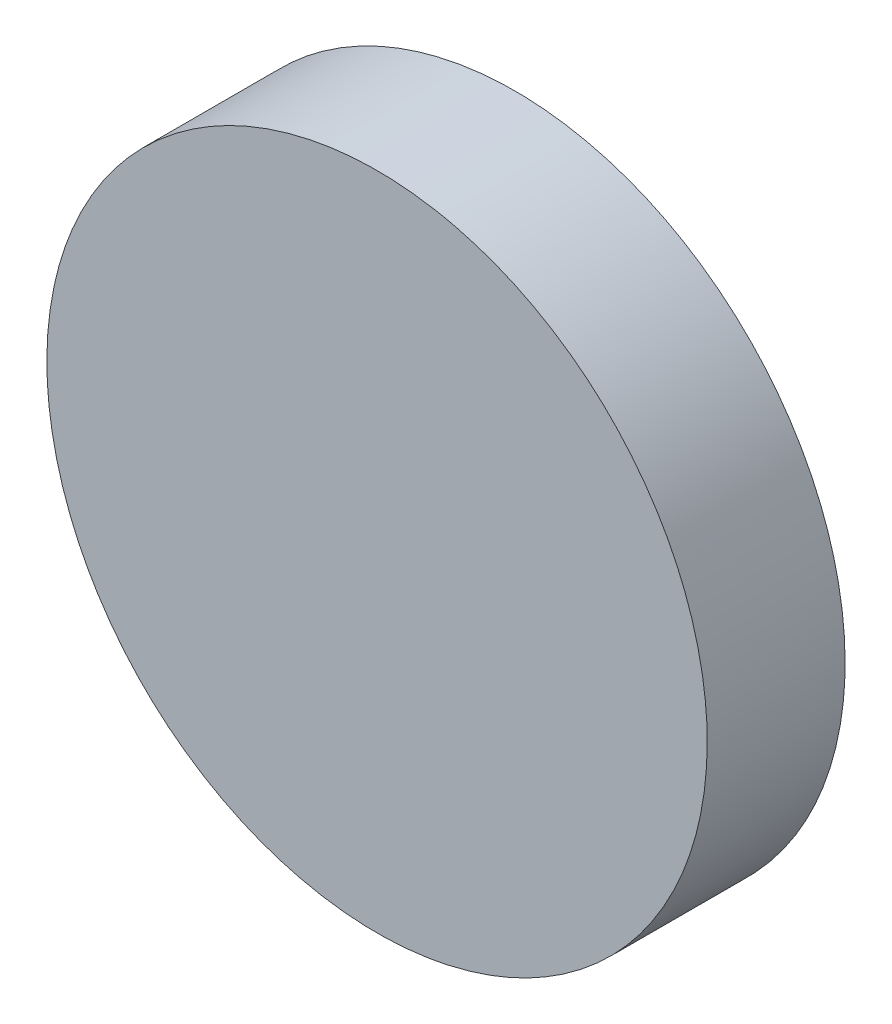
ISO-10303-21;
HEADER;
FILE_DESCRIPTION(('STEP AP214'),'2;1');
FILE_NAME('part.step','',(''),(''),'','','');
FILE_SCHEMA(('AUTOMOTIVE_DESIGN { 1 0 10303 214 1 1 1 1 }'));
ENDSEC;
DATA;
#1=APPLICATION_CONTEXT('core data for automotive mechanical design processes');
#2=APPLICATION_PROTOCOL_DEFINITION('international standard','automotive_design',2000,#1);
#3=PRODUCT_CONTEXT('',#1,'mechanical');
#4=PRODUCT('Part','Part','',(#3));
#5=PRODUCT_RELATED_PRODUCT_CATEGORY('part','',(#4));
#6=PRODUCT_DEFINITION_FORMATION('','',#4);
#7=PRODUCT_DEFINITION_CONTEXT('part definition',#1,'design');
#8=PRODUCT_DEFINITION('design','',#6,#7);
#9=PRODUCT_DEFINITION_SHAPE('','',#8);
#10=(LENGTH_UNIT() NAMED_UNIT(*) SI_UNIT(.MILLI.,.METRE.));
#11=(NAMED_UNIT(*) PLANE_ANGLE_UNIT() SI_UNIT($,.RADIAN.));
#12=(NAMED_UNIT(*) SI_UNIT($,.STERADIAN.) SOLID_ANGLE_UNIT());
#13=UNCERTAINTY_MEASURE_WITH_UNIT(LENGTH_MEASURE(1.E-05),#10,'distance_accuracy_value','');
#14=(GEOMETRIC_REPRESENTATION_CONTEXT(3) GLOBAL_UNCERTAINTY_ASSIGNED_CONTEXT((#13)) GLOBAL_UNIT_ASSIGNED_CONTEXT((#10,
#11,#12)) REPRESENTATION_CONTEXT('',''));
#15=CARTESIAN_POINT('',(0.,0.,0.));
#16=DIRECTION('',(0.,0.,1.));
#17=DIRECTION('',(1.,0.,0.));
#18=AXIS2_PLACEMENT_3D('',#15,#16,#17);
#19=CARTESIAN_POINT('',(7.59384062043357,-7.85,7.2343687668426));
#20=CARTESIAN_POINT('',(7.59384062043357,-7.64139482578253,7.2343687668426));
#21=CARTESIAN_POINT('',(7.51085232233108,-7.22418447734758,7.2343687668426));
#22=CARTESIAN_POINT('',(7.15635630501285,-6.69364369498715,7.2343687668426));
#23=CARTESIAN_POINT('',(6.62581552265242,-6.33914767766892,7.2343687668426));
#24=CARTESIAN_POINT('',(6.,-6.21466523051519,7.2343687668426));
#25=CARTESIAN_POINT('',(5.37418447734758,-6.33914767766892,7.2343687668426));
#26=CARTESIAN_POINT('',(4.84364369498715,-6.69364369498715,7.2343687668426));
#27=CARTESIAN_POINT('',(4.48914767766892,-7.22418447734758,7.2343687668426));
#28=CARTESIAN_POINT('',(4.36466523051519,-7.85,7.2343687668426));
#29=CARTESIAN_POINT('',(4.48914767766892,-8.47581552265242,7.2343687668426));
#30=CARTESIAN_POINT('',(4.84364369498715,-9.00635630501285,7.2343687668426));
#31=CARTESIAN_POINT('',(5.37418447734758,-9.36085232233108,7.2343687668426));
#32=CARTESIAN_POINT('',(6.,-9.48533476948481,7.2343687668426));
#33=CARTESIAN_POINT('',(6.62581552265242,-9.36085232233108,7.2343687668426));
#34=CARTESIAN_POINT('',(7.15635630501285,-9.00635630501285,7.2343687668426));
#35=CARTESIAN_POINT('',(7.51085232233108,-8.47581552265242,7.2343687668426));
#36=CARTESIAN_POINT('',(7.59384062043357,-8.05860517421747,7.2343687668426));
#37=CARTESIAN_POINT('',(7.59384062043357,-7.85,7.2343687668426));
#38=B_SPLINE_CURVE_WITH_KNOTS('',3,(#19,#20,#21,#22,#23,#24,#25,#26,#27,#28,#29,#30,#31,#32,#33,
#34,#35,#36,#37),.UNSPECIFIED.,.T.,.F.,(4,1,1,1,1,1,1,1,1,1,1,1,1,1,1,1,4),(0.,0.0625,0.125,
0.1875,0.25,0.3125,0.375,0.4375,0.5,0.5625,0.625,0.6875,0.75,0.8125,0.875,0.9375,1.),.UNSPECIFIED.);
#39=DIRECTION('',(0.,0.,1.));
#40=VECTOR('',#39,1.);
#41=SURFACE_OF_LINEAR_EXTRUSION('',#38,#40);
#42=CARTESIAN_POINT('',(7.59384062043357,-7.85,7.2343687668426));
#43=CARTESIAN_POINT('',(7.59384062043357,-7.64139482578253,7.2343687668426));
#44=CARTESIAN_POINT('',(7.51085232233108,-7.22418447734758,7.2343687668426));
#45=CARTESIAN_POINT('',(7.15635630501285,-6.69364369498715,7.2343687668426));
#46=CARTESIAN_POINT('',(6.62581552265242,-6.33914767766892,7.2343687668426));
#47=CARTESIAN_POINT('',(6.,-6.21466523051519,7.2343687668426));
#48=CARTESIAN_POINT('',(5.37418447734758,-6.33914767766892,7.2343687668426));
#49=CARTESIAN_POINT('',(4.84364369498715,-6.69364369498715,7.2343687668426));
#50=CARTESIAN_POINT('',(4.48914767766892,-7.22418447734758,7.2343687668426));
#51=CARTESIAN_POINT('',(4.36466523051519,-7.85,7.2343687668426));
#52=CARTESIAN_POINT('',(4.48914767766892,-8.47581552265242,7.2343687668426));
#53=CARTESIAN_POINT('',(4.84364369498715,-9.00635630501285,7.2343687668426));
#54=CARTESIAN_POINT('',(5.37418447734758,-9.36085232233108,7.2343687668426));
#55=CARTESIAN_POINT('',(6.,-9.48533476948481,7.2343687668426));
#56=CARTESIAN_POINT('',(6.62581552265242,-9.36085232233108,7.2343687668426));
#57=CARTESIAN_POINT('',(7.15635630501285,-9.00635630501285,7.2343687668426));
#58=CARTESIAN_POINT('',(7.51085232233108,-8.47581552265242,7.2343687668426));
#59=CARTESIAN_POINT('',(7.59384062043357,-8.05860517421747,7.2343687668426));
#60=CARTESIAN_POINT('',(7.59384062043357,-7.85,7.2343687668426));
#61=B_SPLINE_CURVE_WITH_KNOTS('',3,(#42,#43,#44,#45,#46,#47,#48,#49,#50,#51,#52,#53,#54,#55,#56,
#57,#58,#59,#60),.UNSPECIFIED.,.T.,.F.,(4,1,1,1,1,1,1,1,1,1,1,1,1,1,1,1,4),(0.,0.0625,0.125,
0.1875,0.25,0.3125,0.375,0.4375,0.5,0.5625,0.625,0.6875,0.75,0.8125,0.875,0.9375,1.),.UNSPECIFIED.);
#62=CARTESIAN_POINT('',(7.59384062043357,-7.85,7.2343687668426));
#63=VERTEX_POINT('',#62);
#64=EDGE_CURVE('E9',#63,#63,#61,.T.);
#65=ORIENTED_EDGE('',*,*,#64,.T.);
#66=EDGE_LOOP('',(#65));
#67=FACE_BOUND('',#66,.T.);
#68=CARTESIAN_POINT('',(7.59384062043357,-7.85,7.9));
#69=CARTESIAN_POINT('',(7.59384063931159,-7.87607626205079,7.9));
#70=CARTESIAN_POINT('',(7.59319224601673,-7.90215198285669,7.9));
#71=CARTESIAN_POINT('',(7.59061118055504,-7.9542414022198,7.9));
#72=CARTESIAN_POINT('',(7.58867843283268,-7.9802550970378,7.9));
#73=CARTESIAN_POINT('',(7.58354103066983,-8.03215822267473,7.9));
#74=CARTESIAN_POINT('',(7.58033628894762,-8.0580476448429,7.9));
#75=CARTESIAN_POINT('',(7.57266722700935,-8.10964035851338,7.9));
#76=CARTESIAN_POINT('',(7.56820285246934,-8.13534364193907,7.9));
#77=CARTESIAN_POINT('',(7.55802680332689,-8.18650209986784,7.9));
#78=CARTESIAN_POINT('',(7.55231512872446,-8.21195727437092,7.9));
#79=CARTESIAN_POINT('',(7.53965673600478,-8.26255755947254,7.9));
#80=CARTESIAN_POINT('',(7.53271007116753,-8.28770268339727,7.9));
#81=CARTESIAN_POINT('',(7.51759396529987,-8.33762087734628,7.9));
#82=CARTESIAN_POINT('',(7.50942460821543,-8.3623939727844,7.9));
#83=CARTESIAN_POINT('',(7.49187537053595,-8.41150620297505,7.9));
#84=CARTESIAN_POINT('',(7.48249556118352,-8.43584536317147,7.9));
#85=CARTESIAN_POINT('',(7.4625378934238,-8.48402743536936,7.9));
#86=CARTESIAN_POINT('',(7.4519600350165,-8.50787034737083,7.9));
#87=CARTESIAN_POINT('',(7.42964162893058,-8.55500712338237,7.9));
#88=CARTESIAN_POINT('',(7.41790101288425,-8.57830095500787,7.9));
#89=CARTESIAN_POINT('',(7.393292220576,-8.62428714926546,7.9));
#90=CARTESIAN_POINT('',(7.38042396698504,-8.64697947050907,7.9));
#91=CARTESIAN_POINT('',(7.35359499694329,-8.69171011113872,7.9));
#92=CARTESIAN_POINT('',(7.33963423339477,-8.71374840227321,7.9));
#93=CARTESIAN_POINT('',(7.31065529664887,-8.75711844600313,7.9));
#94=CARTESIAN_POINT('',(7.29563712345149,-8.77845019859857,7.9));
#95=CARTESIAN_POINT('',(7.26457840243973,-8.82035460998663,7.9));
#96=CARTESIAN_POINT('',(7.24853789874991,-8.84092730148047,7.9));
#97=CARTESIAN_POINT('',(7.21546957220525,-8.8812610156734,7.9));
#98=CARTESIAN_POINT('',(7.19844181718092,-8.90102209397652,7.9));
#99=CARTESIAN_POINT('',(7.16343399883695,-8.93968007579376,7.9));
#100=CARTESIAN_POINT('',(7.14545399159995,-8.95857703007835,7.9));
#101=CARTESIAN_POINT('',(7.10857703007835,-8.99545399159994,7.9));
#102=CARTESIAN_POINT('',(7.08968007579376,-9.01343399883694,7.9));
#103=CARTESIAN_POINT('',(7.05102209397652,-9.04844181718091,7.9));
#104=CARTESIAN_POINT('',(7.0312610156734,-9.06546957220525,7.9));
#105=CARTESIAN_POINT('',(6.99092730148048,-9.09853789874991,7.9));
#106=CARTESIAN_POINT('',(6.97035460998665,-9.11457840243973,7.9));
#107=CARTESIAN_POINT('',(6.92845019859856,-9.14563712345149,7.9));
#108=CARTESIAN_POINT('',(6.90711844600309,-9.16065529664887,7.9));
#109=CARTESIAN_POINT('',(6.86374840227325,-9.18963423339477,7.9));
#110=CARTESIAN_POINT('',(6.84171011113888,-9.20359499694329,7.9));
#111=CARTESIAN_POINT('',(6.79697947050891,-9.23042396698503,7.9));
#112=CARTESIAN_POINT('',(6.77428714926487,-9.24329222057596,7.9));
#113=CARTESIAN_POINT('',(6.72830095500848,-9.26790101288428,7.9));
#114=CARTESIAN_POINT('',(6.7050071233846,-9.27964162893071,7.9));
#115=CARTESIAN_POINT('',(6.65787034736861,-9.30196003501637,7.9));
#116=CARTESIAN_POINT('',(6.63402743536107,-9.3125378934233,7.9));
#117=CARTESIAN_POINT('',(6.58584536317978,-9.33249556118402,7.9));
#118=CARTESIAN_POINT('',(6.56150620300604,-9.34187537053782,7.9));
#119=CARTESIAN_POINT('',(6.51239397275342,-9.35942460821356,7.9));
#120=CARTESIAN_POINT('',(6.48762087723062,-9.36759396529288,7.9));
#121=CARTESIAN_POINT('',(6.43770268351295,-9.38271007117451,7.9));
#122=CARTESIAN_POINT('',(6.41255755990424,-9.38965673603087,7.9));
#123=CARTESIAN_POINT('',(6.3619572739392,-9.40231512869838,7.9));
#124=CARTESIAN_POINT('',(6.33650209825663,-9.40802680322955,7.9));
#125=CARTESIAN_POINT('',(6.2853436435503,-9.41820285256667,7.9));
#126=CARTESIAN_POINT('',(6.25964036452654,-9.42266722737262,7.9));
#127=CARTESIAN_POINT('',(6.20804763883,-9.43033628858437,7.9));
#128=CARTESIAN_POINT('',(6.18215820023473,-9.4335410293142,7.9));
#129=CARTESIAN_POINT('',(6.13025511947626,-9.43867843418823,7.9));
#130=CARTESIAN_POINT('',(6.10424148595847,-9.44061118561383,7.9));
#131=CARTESIAN_POINT('',(6.05215189912295,-9.44319224095822,7.9));
#132=CARTESIAN_POINT('',(6.02607594956148,-9.44384062043356,7.9));
#133=CARTESIAN_POINT('',(5.97392405043853,-9.44384062043356,7.9));
#134=CARTESIAN_POINT('',(5.94784810087706,-9.44319224095823,7.9));
#135=CARTESIAN_POINT('',(5.89575851404153,-9.44061118561384,7.9));
#136=CARTESIAN_POINT('',(5.86974488052374,-9.43867843418823,7.9));
#137=CARTESIAN_POINT('',(5.81784179976527,-9.43354102931419,7.9));
#138=CARTESIAN_POINT('',(5.79195236117,-9.43033628858437,7.9));
#139=CARTESIAN_POINT('',(5.74035963547346,-9.42266722737262,7.9));
#140=CARTESIAN_POINT('',(5.71465635644971,-9.41820285256667,7.9));
#141=CARTESIAN_POINT('',(5.66349790174338,-9.40802680322955,7.9));
#142=CARTESIAN_POINT('',(5.6380427260608,-9.40231512869838,7.9));
#143=CARTESIAN_POINT('',(5.58744244009577,-9.38965673603087,7.9));
#144=CARTESIAN_POINT('',(5.56229731648706,-9.38271007117451,7.9));
#145=CARTESIAN_POINT('',(5.51237912276938,-9.36759396529288,7.9));
#146=CARTESIAN_POINT('',(5.48760602724659,-9.35942460821356,7.9));
#147=CARTESIAN_POINT('',(5.43849379699396,-9.34187537053782,7.9));
#148=CARTESIAN_POINT('',(5.41415463682022,-9.33249556118402,7.9));
#149=CARTESIAN_POINT('',(5.36597256463894,-9.3125378934233,7.9));
#150=CARTESIAN_POINT('',(5.3421296526314,-9.30196003501637,7.9));
#151=CARTESIAN_POINT('',(5.2949928766154,-9.27964162893071,7.9));
#152=CARTESIAN_POINT('',(5.27169904499153,-9.26790101288428,7.9));
#153=CARTESIAN_POINT('',(5.22571285073514,-9.24329222057596,7.9));
#154=CARTESIAN_POINT('',(5.20302052949109,-9.23042396698503,7.9));
#155=CARTESIAN_POINT('',(5.15828988886112,-9.20359499694329,7.9));
#156=CARTESIAN_POINT('',(5.13625159772675,-9.18963423339477,7.9));
#157=CARTESIAN_POINT('',(5.09288155399691,-9.16065529664887,7.9));
#158=CARTESIAN_POINT('',(5.07154980140144,-9.14563712345149,7.9));
#159=CARTESIAN_POINT('',(5.02964539001336,-9.11457840243973,7.9));
#160=CARTESIAN_POINT('',(5.00907269851952,-9.09853789874991,7.9));
#161=CARTESIAN_POINT('',(4.9687389843266,-9.06546957220525,7.9));
#162=CARTESIAN_POINT('',(4.94897790602348,-9.04844181718091,7.9));
#163=CARTESIAN_POINT('',(4.91031992420624,-9.01343399883694,7.9));
#164=CARTESIAN_POINT('',(4.89142296992165,-8.99545399159994,7.9));
#165=CARTESIAN_POINT('',(4.85454600840006,-8.95857703007835,7.9));
#166=CARTESIAN_POINT('',(4.83656600116306,-8.93968007579376,7.9));
#167=CARTESIAN_POINT('',(4.80155818281909,-8.90102209397652,7.9));
#168=CARTESIAN_POINT('',(4.78453042779475,-8.8812610156734,7.9));
#169=CARTESIAN_POINT('',(4.75146210125009,-8.84092730148048,7.9));
#170=CARTESIAN_POINT('',(4.73542159756027,-8.82035460998664,7.9));
#171=CARTESIAN_POINT('',(4.70436287654851,-8.77845019859856,7.9));
#172=CARTESIAN_POINT('',(4.68934470335113,-8.75711844600309,7.9));
#173=CARTESIAN_POINT('',(4.66036576660523,-8.71374840227325,7.9));
#174=CARTESIAN_POINT('',(4.64640500305671,-8.69171011113888,7.9));
#175=CARTESIAN_POINT('',(4.61957603301497,-8.64697947050891,7.9));
#176=CARTESIAN_POINT('',(4.60670777942403,-8.62428714926486,7.9));
#177=CARTESIAN_POINT('',(4.58209898711572,-8.57830095500847,7.9));
#178=CARTESIAN_POINT('',(4.57035837106929,-8.5550071233846,7.9));
#179=CARTESIAN_POINT('',(4.54803996498363,-8.5078703473686,7.9));
#180=CARTESIAN_POINT('',(4.5374621065767,-8.48402743536106,7.9));
#181=CARTESIAN_POINT('',(4.51750443881598,-8.43584536317978,7.9));
#182=CARTESIAN_POINT('',(4.50812462946218,-8.41150620300604,7.9));
#183=CARTESIAN_POINT('',(4.49057539178644,-8.36239397275341,7.9));
#184=CARTESIAN_POINT('',(4.48240603470712,-8.33762087723062,7.9));
#185=CARTESIAN_POINT('',(4.46728992882549,-8.28770268351294,7.9));
#186=CARTESIAN_POINT('',(4.46034326396914,-8.26255755990423,7.9));
#187=CARTESIAN_POINT('',(4.44768487130163,-8.2119572739392,7.9));
#188=CARTESIAN_POINT('',(4.44197319677045,-8.18650209825662,7.9));
#189=CARTESIAN_POINT('',(4.43179714743333,-8.13534364355029,7.9));
#190=CARTESIAN_POINT('',(4.42733277262739,-8.10964036452654,7.9));
#191=CARTESIAN_POINT('',(4.41966371141564,-8.05804763883,7.9));
#192=CARTESIAN_POINT('',(4.41645897068581,-8.03215820023473,7.9));
#193=CARTESIAN_POINT('',(4.41132156581178,-7.98025511947626,7.9));
#194=CARTESIAN_POINT('',(4.40938881438617,-7.95424148595847,7.9));
#195=CARTESIAN_POINT('',(4.40680775904178,-7.90215189912294,7.9));
#196=CARTESIAN_POINT('',(4.40615937956644,-7.87607594956147,7.9));
#197=CARTESIAN_POINT('',(4.40615937956644,-7.82392405043853,7.9));
#198=CARTESIAN_POINT('',(4.40680775904178,-7.79784810087705,7.9));
#199=CARTESIAN_POINT('',(4.40938881438617,-7.74575851404153,7.9));
#200=CARTESIAN_POINT('',(4.41132156581178,-7.71974488052374,7.9));
#201=CARTESIAN_POINT('',(4.41645897068581,-7.66784179976527,7.9));
#202=CARTESIAN_POINT('',(4.41966371141563,-7.64195236117,7.9));
#203=CARTESIAN_POINT('',(4.42733277262739,-7.59035963547346,7.9));
#204=CARTESIAN_POINT('',(4.43179714743333,-7.5646563564497,7.9));
#205=CARTESIAN_POINT('',(4.44197319677045,-7.51349790174337,7.9));
#206=CARTESIAN_POINT('',(4.44768487130163,-7.4880427260608,7.9));
#207=CARTESIAN_POINT('',(4.46034326396914,-7.43744244009577,7.9));
#208=CARTESIAN_POINT('',(4.46728992882549,-7.41229731648706,7.9));
#209=CARTESIAN_POINT('',(4.48240603470712,-7.36237912276938,7.9));
#210=CARTESIAN_POINT('',(4.49057539178644,-7.33760602724659,7.9));
#211=CARTESIAN_POINT('',(4.50812462946218,-7.28849379699396,7.9));
#212=CARTESIAN_POINT('',(4.51750443881598,-7.26415463682022,7.9));
#213=CARTESIAN_POINT('',(4.5374621065767,-7.21597256463894,7.9));
#214=CARTESIAN_POINT('',(4.54803996498363,-7.1921296526314,7.9));
#215=CARTESIAN_POINT('',(4.57035837106929,-7.1449928766154,7.9));
#216=CARTESIAN_POINT('',(4.58209898711572,-7.12169904499153,7.9));
#217=CARTESIAN_POINT('',(4.60670777942403,-7.07571285073514,7.9));
#218=CARTESIAN_POINT('',(4.61957603301497,-7.05302052949109,7.9));
#219=CARTESIAN_POINT('',(4.64640500305671,-7.00828988886112,7.9));
#220=CARTESIAN_POINT('',(4.66036576660523,-6.98625159772675,7.9));
#221=CARTESIAN_POINT('',(4.68934470335113,-6.94288155399691,7.9));
#222=CARTESIAN_POINT('',(4.70436287654851,-6.92154980140144,7.9));
#223=CARTESIAN_POINT('',(4.73542159756027,-6.87964539001336,7.9));
#224=CARTESIAN_POINT('',(4.75146210125009,-6.85907269851952,7.9));
#225=CARTESIAN_POINT('',(4.78453042779475,-6.8187389843266,7.9));
#226=CARTESIAN_POINT('',(4.80155818281909,-6.79897790602348,7.9));
#227=CARTESIAN_POINT('',(4.83656600116306,-6.76031992420624,7.9));
#228=CARTESIAN_POINT('',(4.85454600840006,-6.74142296992165,7.9));
#229=CARTESIAN_POINT('',(4.89142296992165,-6.70454600840006,7.9));
#230=CARTESIAN_POINT('',(4.91031992420624,-6.68656600116305,7.9));
#231=CARTESIAN_POINT('',(4.94897790602348,-6.65155818281909,7.9));
#232=CARTESIAN_POINT('',(4.96873898432661,-6.63453042779475,7.9));
#233=CARTESIAN_POINT('',(5.00907269851953,-6.60146210125009,7.9));
#234=CARTESIAN_POINT('',(5.02964539001336,-6.58542159756027,7.9));
#235=CARTESIAN_POINT('',(5.07154980140144,-6.55436287654851,7.9));
#236=CARTESIAN_POINT('',(5.09288155399691,-6.53934470335113,7.9));
#237=CARTESIAN_POINT('',(5.13625159772675,-6.51036576660522,7.9));
#238=CARTESIAN_POINT('',(5.15828988886112,-6.4964050030567,7.9));
#239=CARTESIAN_POINT('',(5.20302052949109,-6.46957603301497,7.9));
#240=CARTESIAN_POINT('',(5.22571285073514,-6.45670777942403,7.9));
#241=CARTESIAN_POINT('',(5.27169904499153,-6.43209898711572,7.9));
#242=CARTESIAN_POINT('',(5.2949928766154,-6.42035837106929,7.9));
#243=CARTESIAN_POINT('',(5.3421296526314,-6.39803996498363,7.9));
#244=CARTESIAN_POINT('',(5.36597256463894,-6.3874621065767,7.9));
#245=CARTESIAN_POINT('',(5.41415463682022,-6.36750443881597,7.9));
#246=CARTESIAN_POINT('',(5.43849379699396,-6.35812462946218,7.9));
#247=CARTESIAN_POINT('',(5.48760602724659,-6.34057539178644,7.9));
#248=CARTESIAN_POINT('',(5.51237912276938,-6.33240603470712,7.9));
#249=CARTESIAN_POINT('',(5.56229731648706,-6.31728992882548,7.9));
#250=CARTESIAN_POINT('',(5.58744244009577,-6.31034326396914,7.9));
#251=CARTESIAN_POINT('',(5.6380427260608,-6.29768487130162,7.9));
#252=CARTESIAN_POINT('',(5.66349790174338,-6.29197319677045,7.9));
#253=CARTESIAN_POINT('',(5.71465635644971,-6.28179714743333,7.9));
#254=CARTESIAN_POINT('',(5.74035963547346,-6.27733277262738,7.9));
#255=CARTESIAN_POINT('',(5.79195236117,-6.26966371141563,7.9));
#256=CARTESIAN_POINT('',(5.81784179976527,-6.2664589706858,7.9));
#257=CARTESIAN_POINT('',(5.86974488052375,-6.26132156581177,7.9));
#258=CARTESIAN_POINT('',(5.89575851404153,-6.25938881438616,7.9));
#259=CARTESIAN_POINT('',(5.94784810087706,-6.25680775904177,7.9));
#260=CARTESIAN_POINT('',(5.97392405043853,-6.25615937956643,7.9));
#261=CARTESIAN_POINT('',(6.02607594956148,-6.25615937956643,7.9));
#262=CARTESIAN_POINT('',(6.05215189912295,-6.25680775904177,7.9));
#263=CARTESIAN_POINT('',(6.10424148595847,-6.25938881438616,7.9));
#264=CARTESIAN_POINT('',(6.13025511947626,-6.26132156581177,7.9));
#265=CARTESIAN_POINT('',(6.18215820023473,-6.2664589706858,7.9));
#266=CARTESIAN_POINT('',(6.20804763883,-6.26966371141563,7.9));
#267=CARTESIAN_POINT('',(6.25964036452654,-6.27733277262738,7.9));
#268=CARTESIAN_POINT('',(6.2853436435503,-6.28179714743333,7.9));
#269=CARTESIAN_POINT('',(6.33650209825663,-6.29197319677045,7.9));
#270=CARTESIAN_POINT('',(6.3619572739392,-6.29768487130162,7.9));
#271=CARTESIAN_POINT('',(6.41255755990424,-6.31034326396914,7.9));
#272=CARTESIAN_POINT('',(6.43770268351294,-6.31728992882549,7.9));
#273=CARTESIAN_POINT('',(6.48762087723062,-6.33240603470712,7.9));
#274=CARTESIAN_POINT('',(6.51239397275342,-6.34057539178644,7.9));
#275=CARTESIAN_POINT('',(6.56150620300604,-6.35812462946218,7.9));
#276=CARTESIAN_POINT('',(6.58584536317978,-6.36750443881597,7.9));
#277=CARTESIAN_POINT('',(6.63402743536106,-6.3874621065767,7.9));
#278=CARTESIAN_POINT('',(6.65787034736861,-6.39803996498363,7.9));
#279=CARTESIAN_POINT('',(6.7050071233846,-6.42035837106929,7.9));
#280=CARTESIAN_POINT('',(6.72830095500848,-6.43209898711572,7.9));
#281=CARTESIAN_POINT('',(6.77428714926487,-6.45670777942403,7.9));
#282=CARTESIAN_POINT('',(6.79697947050891,-6.46957603301497,7.9));
#283=CARTESIAN_POINT('',(6.84171011113888,-6.4964050030567,7.9));
#284=CARTESIAN_POINT('',(6.86374840227325,-6.51036576660522,7.9));
#285=CARTESIAN_POINT('',(6.90711844600309,-6.53934470335113,7.9));
#286=CARTESIAN_POINT('',(6.92845019859856,-6.55436287654851,7.9));
#287=CARTESIAN_POINT('',(6.97035460998665,-6.58542159756027,7.9));
#288=CARTESIAN_POINT('',(6.99092730148048,-6.60146210125009,7.9));
#289=CARTESIAN_POINT('',(7.0312610156734,-6.63453042779475,7.9));
#290=CARTESIAN_POINT('',(7.05102209397652,-6.65155818281909,7.9));
#291=CARTESIAN_POINT('',(7.08968007579376,-6.68656600116305,7.9));
#292=CARTESIAN_POINT('',(7.10857703007836,-6.70454600840005,7.9));
#293=CARTESIAN_POINT('',(7.14545399159995,-6.74142296992165,7.9));
#294=CARTESIAN_POINT('',(7.16343399883695,-6.76031992420624,7.9));
#295=CARTESIAN_POINT('',(7.19844181718092,-6.79897790602348,7.9));
#296=CARTESIAN_POINT('',(7.21546957220525,-6.8187389843266,7.9));
#297=CARTESIAN_POINT('',(7.24853789874991,-6.85907269851953,7.9));
#298=CARTESIAN_POINT('',(7.26457840243973,-6.87964539001337,7.9));
#299=CARTESIAN_POINT('',(7.29563712345149,-6.92154980140143,7.9));
#300=CARTESIAN_POINT('',(7.31065529664888,-6.94288155399687,7.9));
#301=CARTESIAN_POINT('',(7.33963423339478,-6.98625159772679,7.9));
#302=CARTESIAN_POINT('',(7.35359499694329,-7.00828988886128,7.9));
#303=CARTESIAN_POINT('',(7.38042396698504,-7.05302052949093,7.9));
#304=CARTESIAN_POINT('',(7.393292220576,-7.07571285073454,7.9));
#305=CARTESIAN_POINT('',(7.41790101288425,-7.12169904499212,7.9));
#306=CARTESIAN_POINT('',(7.42964162893058,-7.14499287661762,7.9));
#307=CARTESIAN_POINT('',(7.45196003501651,-7.19212965262917,7.9));
#308=CARTESIAN_POINT('',(7.4625378934238,-7.21597256463063,7.9));
#309=CARTESIAN_POINT('',(7.48249556118353,-7.26415463682852,7.9));
#310=CARTESIAN_POINT('',(7.49187537053595,-7.28849379702495,7.9));
#311=CARTESIAN_POINT('',(7.50942460821543,-7.3376060272156,7.9));
#312=CARTESIAN_POINT('',(7.51759396529987,-7.36237912265372,7.9));
#313=CARTESIAN_POINT('',(7.53271007116753,-7.41229731660273,7.9));
#314=CARTESIAN_POINT('',(7.53965673600479,-7.43744244052746,7.9));
#315=CARTESIAN_POINT('',(7.55231512872446,-7.48804272562908,7.9));
#316=CARTESIAN_POINT('',(7.55802680332689,-7.51349790013216,7.9));
#317=CARTESIAN_POINT('',(7.56820285246934,-7.56465635806092,7.9));
#318=CARTESIAN_POINT('',(7.57266722700935,-7.59035964148662,7.9));
#319=CARTESIAN_POINT('',(7.58033628894762,-7.6419523551571,7.9));
#320=CARTESIAN_POINT('',(7.58354103066984,-7.66784177732527,7.9));
#321=CARTESIAN_POINT('',(7.58867843283268,-7.7197449029622,7.9));
#322=CARTESIAN_POINT('',(7.59061118055504,-7.7457585977802,7.9));
#323=CARTESIAN_POINT('',(7.59319224601673,-7.79784801714331,7.9));
#324=CARTESIAN_POINT('',(7.59384063931159,-7.82392373794921,7.9));
#325=CARTESIAN_POINT('',(7.59384062043357,-7.85,7.9));
#326=B_SPLINE_CURVE_WITH_KNOTS('',3,(#68,#69,#70,#71,#72,#73,#74,#75,#76,#77,#78,#79,#80,#81,
#82,#83,#84,#85,#86,#87,#88,#89,#90,#91,#92,#93,#94,#95,#96,#97,#98,#99,#100,#101,#102,#103,
#104,#105,#106,#107,#108,#109,#110,#111,#112,#113,#114,#115,#116,#117,#118,#119,#120,#121,#122,
#123,#124,#125,#126,#127,#128,#129,#130,#131,#132,#133,#134,#135,#136,#137,#138,#139,#140,#141,
#142,#143,#144,#145,#146,#147,#148,#149,#150,#151,#152,#153,#154,#155,#156,#157,#158,#159,#160,
#161,#162,#163,#164,#165,#166,#167,#168,#169,#170,#171,#172,#173,#174,#175,#176,#177,#178,#179,
#180,#181,#182,#183,#184,#185,#186,#187,#188,#189,#190,#191,#192,#193,#194,#195,#196,#197,#198,
#199,#200,#201,#202,#203,#204,#205,#206,#207,#208,#209,#210,#211,#212,#213,#214,#215,#216,#217,
#218,#219,#220,#221,#222,#223,#224,#225,#226,#227,#228,#229,#230,#231,#232,#233,#234,#235,#236,
#237,#238,#239,#240,#241,#242,#243,#244,#245,#246,#247,#248,#249,#250,#251,#252,#253,#254,#255,
#256,#257,#258,#259,#260,#261,#262,#263,#264,#265,#266,#267,#268,#269,#270,#271,#272,#273,#274,
#275,#276,#277,#278,#279,#280,#281,#282,#283,#284,#285,#286,#287,#288,#289,#290,#291,#292,#293,
#294,#295,#296,#297,#298,#299,#300,#301,#302,#303,#304,#305,#306,#307,#308,#309,#310,#311,#312,
#313,#314,#315,#316,#317,#318,#319,#320,#321,#322,#323,#324,#325),.UNSPECIFIED.,.F.,.F.,(4,2,2,
2,2,2,2,2,2,2,2,2,2,2,2,2,2,2,2,2,2,2,2,2,2,2,2,2,2,2,2,2,2,2,2,2,2,2,2,2,2,2,2,2,2,2,2,2,2,2,2,
2,2,2,2,2,2,2,2,2,2,2,2,2,2,2,2,2,2,2,2,2,2,2,2,2,2,2,2,2,2,2,2,2,2,2,2,2,2,2,2,2,2,2,2,2,2,2,2,
2,2,2,2,2,2,2,2,2,2,2,2,2,2,2,2,2,2,2,2,2,2,2,2,2,2,2,2,2,4),(0.,0.0782199598708585,
0.156444521643892,0.234674451960651,0.312907756602051,0.391141061243452,0.469370991560211,
0.547595553333245,0.625815513204102,0.70403547307496,0.782260034847992,0.860489965164755,
0.938723269806155,1.01695657444755,1.09518650476431,1.17341106653735,1.25163102640821,
1.32985098627906,1.4080755480521,1.48630547836886,1.56453878301026,1.64277208765166,
1.72100201796842,1.79922657974145,1.87744653961231,1.95566649948317,2.0338910612562,
2.11212099157296,2.19035429621436,2.26858760085576,2.34681753117252,2.42504209294556,
2.50326205281641,2.58148201268727,2.65970657446031,2.73793650477707,2.81616980941847,
2.89440311405987,2.97263304437663,3.05085760614966,3.12907756602052,3.20729752589137,
3.28552208766441,3.36375201798117,3.44198532262257,3.52021862726397,3.59844855758073,
3.67667311935377,3.75489307922462,3.83311303909548,3.91133760086852,3.98956753118528,
4.06780083582667,4.14603414046808,4.22426407078483,4.30248863255787,4.38070859242873,
4.45892855229958,4.53715311407262,4.61538304438938,4.69361634903078,4.77184965367218,
4.85007958398894,4.92830414576197,5.00652410563283,5.08474406550368,5.16296862727672,
5.24119855759348,5.31943186223488,5.39766516687628,5.47589509719304,5.55411965896607,
5.63233961883693,5.71055957870779,5.78878414048082,5.86701407079758,5.94524737543898,
6.02348068008038,6.10171061039714,6.17993517217018,6.25815513204103,6.33637509191189,
6.41459965368493,6.49282958400169,6.57106288864309,6.64929619328449,6.72752612360125,
6.80575068537428,6.88397064524514,6.962190605116,7.04041516688903,7.11864509720579,
7.19687840184719,7.27511170648859,7.35334163680535,7.43156619857839,7.50978615844924,
7.5880061183201,7.66623068009313,7.74446061040989,7.82269391505129,7.90092721969269,
7.97915715000946,8.05738171178249,8.13560167165335,8.2138216315242,8.29204619329724,
8.370276123614,8.4485094282554,8.5267427328968,8.60497266321356,8.68319722498659,
8.76141718485745,8.83963714472831,8.91786170650134,8.9960916368181,9.0743249414595,
9.1525582461009,9.23078817641766,9.3090127381907,9.38723269806156,9.46545265793241,
9.54367721970545,9.6219071500222,9.70014045466361,9.778373759305,9.85660368962176,
9.9348282513948,10.0130482112657),.UNSPECIFIED.);
#327=CARTESIAN_POINT('',(7.59384062043357,-7.85,7.9));
#328=VERTEX_POINT('',#327);
#329=EDGE_CURVE('E24',#328,#328,#326,.F.);
#330=ORIENTED_EDGE('',*,*,#329,.F.);
#331=EDGE_LOOP('',(#330));
#332=FACE_BOUND('',#331,.T.);
#333=ADVANCED_FACE('F14',(#67,#332),#41,.T.);
#334=CARTESIAN_POINT('',(-3.5,-7.85,7.2343687668426));
#335=DIRECTION('',(0.,0.,1.));
#336=DIRECTION('',(0.,-1.,0.));
#337=AXIS2_PLACEMENT_3D('',#334,#335,#336);
#338=PLANE('',#337);
#339=ORIENTED_EDGE('',*,*,#64,.F.);
#340=EDGE_LOOP('',(#339));
#341=FACE_BOUND('',#340,.T.);
#342=ADVANCED_FACE('F62',(#341),#338,.F.);
#343=CARTESIAN_POINT('',(-3.5,-7.85,7.9));
#344=DIRECTION('',(0.,0.,1.));
#345=DIRECTION('',(0.,-1.,0.));
#346=AXIS2_PLACEMENT_3D('',#343,#344,#345);
#347=PLANE('',#346);
#348=ORIENTED_EDGE('',*,*,#329,.T.);
#349=EDGE_LOOP('',(#348));
#350=FACE_BOUND('',#349,.T.);
#351=ADVANCED_FACE('F31',(#350),#347,.T.);
#352=CLOSED_SHELL('',(#333,#342,#351));
#353=MANIFOLD_SOLID_BREP('B1',#352);
#354=ADVANCED_BREP_SHAPE_REPRESENTATION('',(#18,#353),#14);
#355=SHAPE_DEFINITION_REPRESENTATION(#9,#354);
ENDSEC;
END-ISO-10303-21;
